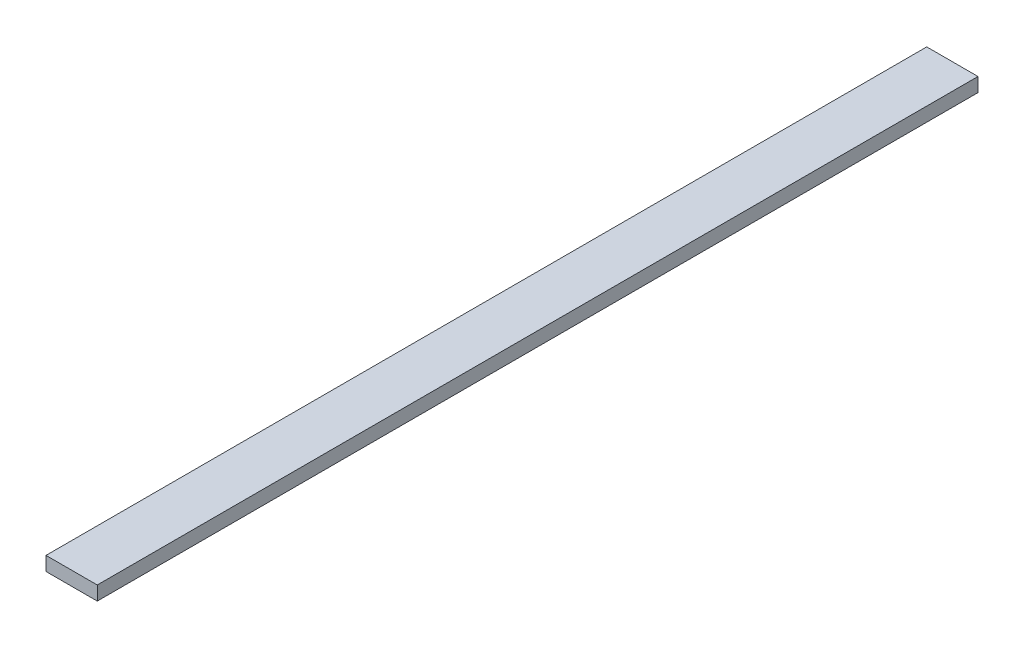
ISO-10303-21;
HEADER;
FILE_DESCRIPTION(('STEP AP214'),'2;1');
FILE_NAME('part.step','',(''),(''),'','','');
FILE_SCHEMA(('AUTOMOTIVE_DESIGN { 1 0 10303 214 1 1 1 1 }'));
ENDSEC;
DATA;
#1=APPLICATION_CONTEXT('core data for automotive mechanical design processes');
#2=APPLICATION_PROTOCOL_DEFINITION('international standard','automotive_design',2000,#1);
#3=PRODUCT_CONTEXT('',#1,'mechanical');
#4=PRODUCT('Part','Part','',(#3));
#5=PRODUCT_RELATED_PRODUCT_CATEGORY('part','',(#4));
#6=PRODUCT_DEFINITION_FORMATION('','',#4);
#7=PRODUCT_DEFINITION_CONTEXT('part definition',#1,'design');
#8=PRODUCT_DEFINITION('design','',#6,#7);
#9=PRODUCT_DEFINITION_SHAPE('','',#8);
#10=(LENGTH_UNIT() NAMED_UNIT(*) SI_UNIT(.MILLI.,.METRE.));
#11=(NAMED_UNIT(*) PLANE_ANGLE_UNIT() SI_UNIT($,.RADIAN.));
#12=(NAMED_UNIT(*) SI_UNIT($,.STERADIAN.) SOLID_ANGLE_UNIT());
#13=UNCERTAINTY_MEASURE_WITH_UNIT(LENGTH_MEASURE(1.E-05),#10,'distance_accuracy_value','');
#14=(GEOMETRIC_REPRESENTATION_CONTEXT(3) GLOBAL_UNCERTAINTY_ASSIGNED_CONTEXT((#13)) GLOBAL_UNIT_ASSIGNED_CONTEXT((#10,
#11,#12)) REPRESENTATION_CONTEXT('',''));
#15=CARTESIAN_POINT('',(0.,0.,0.));
#16=DIRECTION('',(0.,0.,1.));
#17=DIRECTION('',(1.,0.,0.));
#18=AXIS2_PLACEMENT_3D('',#15,#16,#17);
#19=CARTESIAN_POINT('',(0.,0.,2438.4));
#20=DIRECTION('',(1.,0.,0.));
#21=DIRECTION('',(0.,0.,-1.));
#22=AXIS2_PLACEMENT_3D('',#19,#20,#21);
#23=PLANE('',#22);
#24=DIRECTION('',(0.,0.,-1.));
#25=VECTOR('',#24,1.);
#26=CARTESIAN_POINT('',(0.,0.,2438.4));
#27=LINE('',#26,#25);
#28=CARTESIAN_POINT('',(0.,0.,2400.3));
#29=VERTEX_POINT('',#28);
#30=CARTESIAN_POINT('',(0.,0.,0.));
#31=VERTEX_POINT('',#30);
#32=EDGE_CURVE('E11',#29,#31,#27,.T.);
#33=ORIENTED_EDGE('',*,*,#32,.F.);
#34=DIRECTION('',(0.,1.,0.));
#35=VECTOR('',#34,1.);
#36=CARTESIAN_POINT('',(0.,0.,2400.3));
#37=LINE('',#36,#35);
#38=CARTESIAN_POINT('',(0.,38.1,2400.3));
#39=VERTEX_POINT('',#38);
#40=EDGE_CURVE('E84',#29,#39,#37,.T.);
#41=ORIENTED_EDGE('',*,*,#40,.T.);
#42=DIRECTION('',(0.,0.,-1.));
#43=VECTOR('',#42,1.);
#44=CARTESIAN_POINT('',(0.,38.1,2438.4));
#45=LINE('',#44,#43);
#46=CARTESIAN_POINT('',(0.,38.1,0.));
#47=VERTEX_POINT('',#46);
#48=EDGE_CURVE('E65',#39,#47,#45,.T.);
#49=ORIENTED_EDGE('',*,*,#48,.T.);
#50=DIRECTION('',(0.,-1.,0.));
#51=VECTOR('',#50,1.);
#52=CARTESIAN_POINT('',(0.,0.,0.));
#53=LINE('',#52,#51);
#54=EDGE_CURVE('E117',#47,#31,#53,.T.);
#55=ORIENTED_EDGE('',*,*,#54,.T.);
#56=EDGE_LOOP('',(#33,#41,#49,#55));
#57=FACE_BOUND('',#56,.T.);
#58=ADVANCED_FACE('F42',(#57),#23,.F.);
#59=CARTESIAN_POINT('',(0.,0.,2438.4));
#60=DIRECTION('',(0.,1.,0.));
#61=DIRECTION('',(0.,0.,1.));
#62=AXIS2_PLACEMENT_3D('',#59,#60,#61);
#63=PLANE('',#62);
#64=DIRECTION('',(0.,0.,-1.));
#65=VECTOR('',#64,1.);
#66=CARTESIAN_POINT('',(139.7,0.,2438.4));
#67=LINE('',#66,#65);
#68=CARTESIAN_POINT('',(139.7,0.,2400.3));
#69=VERTEX_POINT('',#68);
#70=CARTESIAN_POINT('',(139.7,0.,0.));
#71=VERTEX_POINT('',#70);
#72=EDGE_CURVE('E50',#69,#71,#67,.T.);
#73=ORIENTED_EDGE('',*,*,#72,.F.);
#74=DIRECTION('',(-1.,0.,0.));
#75=VECTOR('',#74,1.);
#76=CARTESIAN_POINT('',(139.7,0.,2400.3));
#77=LINE('',#76,#75);
#78=EDGE_CURVE('E82',#69,#29,#77,.T.);
#79=ORIENTED_EDGE('',*,*,#78,.T.);
#80=ORIENTED_EDGE('',*,*,#32,.T.);
#81=DIRECTION('',(1.,0.,0.));
#82=VECTOR('',#81,1.);
#83=CARTESIAN_POINT('',(0.,0.,0.));
#84=LINE('',#83,#82);
#85=EDGE_CURVE('E101',#31,#71,#84,.T.);
#86=ORIENTED_EDGE('',*,*,#85,.T.);
#87=EDGE_LOOP('',(#73,#79,#80,#86));
#88=FACE_BOUND('',#87,.T.);
#89=ADVANCED_FACE('F99',(#88),#63,.F.);
#90=CARTESIAN_POINT('',(139.7,0.,2438.4));
#91=DIRECTION('',(-1.,0.,0.));
#92=DIRECTION('',(0.,0.,1.));
#93=AXIS2_PLACEMENT_3D('',#90,#91,#92);
#94=PLANE('',#93);
#95=DIRECTION('',(0.,0.,-1.));
#96=VECTOR('',#95,1.);
#97=CARTESIAN_POINT('',(139.7,38.1,2438.4));
#98=LINE('',#97,#96);
#99=CARTESIAN_POINT('',(139.7,38.1,2400.3));
#100=VERTEX_POINT('',#99);
#101=CARTESIAN_POINT('',(139.7,38.1,0.));
#102=VERTEX_POINT('',#101);
#103=EDGE_CURVE('E96',#100,#102,#98,.T.);
#104=ORIENTED_EDGE('',*,*,#103,.F.);
#105=DIRECTION('',(0.,1.,0.));
#106=VECTOR('',#105,1.);
#107=CARTESIAN_POINT('',(139.7,0.,2400.3));
#108=LINE('',#107,#106);
#109=EDGE_CURVE('E57',#69,#100,#108,.T.);
#110=ORIENTED_EDGE('',*,*,#109,.F.);
#111=ORIENTED_EDGE('',*,*,#72,.T.);
#112=DIRECTION('',(0.,1.,0.));
#113=VECTOR('',#112,1.);
#114=CARTESIAN_POINT('',(139.7,0.,0.));
#115=LINE('',#114,#113);
#116=EDGE_CURVE('E112',#71,#102,#115,.T.);
#117=ORIENTED_EDGE('',*,*,#116,.T.);
#118=EDGE_LOOP('',(#104,#110,#111,#117));
#119=FACE_BOUND('',#118,.T.);
#120=ADVANCED_FACE('F93',(#119),#94,.F.);
#121=CARTESIAN_POINT('',(0.,38.1,2438.4));
#122=DIRECTION('',(0.,-1.,0.));
#123=DIRECTION('',(0.,0.,-1.));
#124=AXIS2_PLACEMENT_3D('',#121,#122,#123);
#125=PLANE('',#124);
#126=ORIENTED_EDGE('',*,*,#48,.F.);
#127=DIRECTION('',(-1.,0.,0.));
#128=VECTOR('',#127,1.);
#129=CARTESIAN_POINT('',(139.7,38.1,2400.3));
#130=LINE('',#129,#128);
#131=EDGE_CURVE('E89',#100,#39,#130,.T.);
#132=ORIENTED_EDGE('',*,*,#131,.F.);
#133=ORIENTED_EDGE('',*,*,#103,.T.);
#134=DIRECTION('',(-1.,0.,0.));
#135=VECTOR('',#134,1.);
#136=CARTESIAN_POINT('',(0.,38.1,0.));
#137=LINE('',#136,#135);
#138=EDGE_CURVE('E109',#102,#47,#137,.T.);
#139=ORIENTED_EDGE('',*,*,#138,.T.);
#140=EDGE_LOOP('',(#126,#132,#133,#139));
#141=FACE_BOUND('',#140,.T.);
#142=ADVANCED_FACE('F124',(#141),#125,.F.);
#143=CARTESIAN_POINT('',(0.,0.,0.));
#144=DIRECTION('',(0.,0.,-1.));
#145=DIRECTION('',(-1.,0.,0.));
#146=AXIS2_PLACEMENT_3D('',#143,#144,#145);
#147=PLANE('',#146);
#148=ORIENTED_EDGE('',*,*,#54,.F.);
#149=ORIENTED_EDGE('',*,*,#138,.F.);
#150=ORIENTED_EDGE('',*,*,#116,.F.);
#151=ORIENTED_EDGE('',*,*,#85,.F.);
#152=EDGE_LOOP('',(#148,#149,#150,#151));
#153=FACE_BOUND('',#152,.T.);
#154=ADVANCED_FACE('F128',(#153),#147,.T.);
#155=CARTESIAN_POINT('',(139.7,0.,2400.3));
#156=DIRECTION('',(0.,0.,-1.));
#157=DIRECTION('',(-1.,0.,0.));
#158=AXIS2_PLACEMENT_3D('',#155,#156,#157);
#159=PLANE('',#158);
#160=ORIENTED_EDGE('',*,*,#131,.T.);
#161=ORIENTED_EDGE('',*,*,#40,.F.);
#162=ORIENTED_EDGE('',*,*,#78,.F.);
#163=ORIENTED_EDGE('',*,*,#109,.T.);
#164=EDGE_LOOP('',(#160,#161,#162,#163));
#165=FACE_BOUND('',#164,.T.);
#166=ADVANCED_FACE('F83',(#165),#159,.F.);
#167=CLOSED_SHELL('',(#58,#89,#120,#142,#154,#166));
#168=MANIFOLD_SOLID_BREP('B2',#167);
#169=ADVANCED_BREP_SHAPE_REPRESENTATION('',(#18,#168),#14);
#170=SHAPE_DEFINITION_REPRESENTATION(#9,#169);
ENDSEC;
END-ISO-10303-21;
